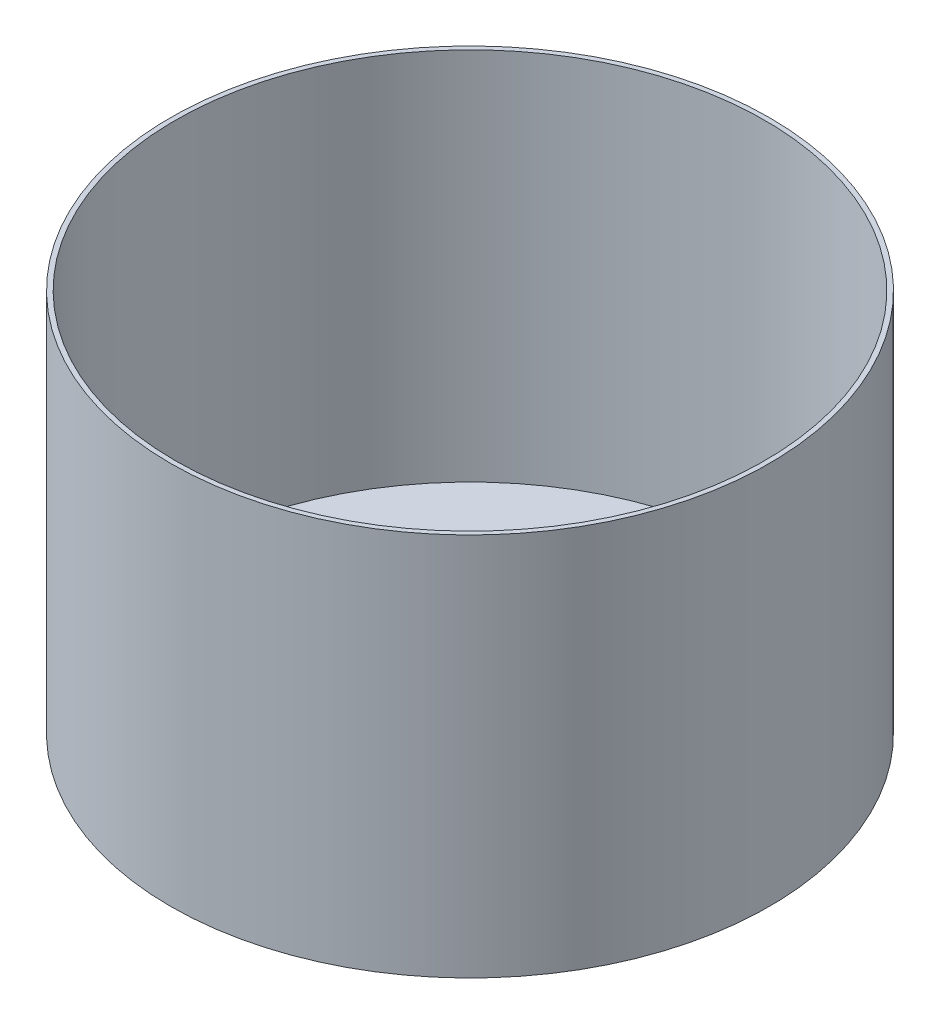
ISO-10303-21;
HEADER;
FILE_DESCRIPTION(('STEP AP214'),'2;1');
FILE_NAME('part.step','',(''),(''),'','','');
FILE_SCHEMA(('AUTOMOTIVE_DESIGN { 1 0 10303 214 1 1 1 1 }'));
ENDSEC;
DATA;
#1=APPLICATION_CONTEXT('core data for automotive mechanical design processes');
#2=APPLICATION_PROTOCOL_DEFINITION('international standard','automotive_design',2000,#1);
#3=PRODUCT_CONTEXT('',#1,'mechanical');
#4=PRODUCT('Part','Part','',(#3));
#5=PRODUCT_RELATED_PRODUCT_CATEGORY('part','',(#4));
#6=PRODUCT_DEFINITION_FORMATION('','',#4);
#7=PRODUCT_DEFINITION_CONTEXT('part definition',#1,'design');
#8=PRODUCT_DEFINITION('design','',#6,#7);
#9=PRODUCT_DEFINITION_SHAPE('','',#8);
#10=(LENGTH_UNIT() NAMED_UNIT(*) SI_UNIT(.MILLI.,.METRE.));
#11=(NAMED_UNIT(*) PLANE_ANGLE_UNIT() SI_UNIT($,.RADIAN.));
#12=(NAMED_UNIT(*) SI_UNIT($,.STERADIAN.) SOLID_ANGLE_UNIT());
#13=UNCERTAINTY_MEASURE_WITH_UNIT(LENGTH_MEASURE(1.E-05),#10,'distance_accuracy_value','');
#14=(GEOMETRIC_REPRESENTATION_CONTEXT(3) GLOBAL_UNCERTAINTY_ASSIGNED_CONTEXT((#13)) GLOBAL_UNIT_ASSIGNED_CONTEXT((#10,
#11,#12)) REPRESENTATION_CONTEXT('',''));
#15=CARTESIAN_POINT('',(0.,0.,0.));
#16=DIRECTION('',(0.,0.,1.));
#17=DIRECTION('',(1.,0.,0.));
#18=AXIS2_PLACEMENT_3D('',#15,#16,#17);
#19=CARTESIAN_POINT('',(0.,6.35,0.));
#20=DIRECTION('',(0.,1.,0.));
#21=DIRECTION('',(0.,0.,1.));
#22=AXIS2_PLACEMENT_3D('',#19,#20,#21);
#23=PLANE('',#22);
#24=CARTESIAN_POINT('',(0.,6.35,0.));
#25=DIRECTION('',(0.,1.,0.));
#26=DIRECTION('',(0.,0.,1.));
#27=AXIS2_PLACEMENT_3D('',#24,#25,#26);
#28=CIRCLE('',#27,200.025);
#29=CARTESIAN_POINT('',(0.,6.35,200.025));
#30=VERTEX_POINT('',#29);
#31=EDGE_CURVE('E18',#30,#30,#28,.T.);
#32=ORIENTED_EDGE('',*,*,#31,.T.);
#33=EDGE_LOOP('',(#32));
#34=FACE_BOUND('',#33,.T.);
#35=ADVANCED_FACE('F15',(#34),#23,.T.);
#36=CARTESIAN_POINT('',(0.,6.35,0.));
#37=DIRECTION('',(0.,1.,0.));
#38=DIRECTION('',(0.,0.,1.));
#39=AXIS2_PLACEMENT_3D('',#36,#37,#38);
#40=CYLINDRICAL_SURFACE('',#39,200.025);
#41=ORIENTED_EDGE('',*,*,#31,.F.);
#42=EDGE_LOOP('',(#41));
#43=FACE_BOUND('',#42,.T.);
#44=CARTESIAN_POINT('',(0.,260.35,0.));
#45=DIRECTION('',(0.,1.,0.));
#46=DIRECTION('',(0.,0.,1.));
#47=AXIS2_PLACEMENT_3D('',#44,#45,#46);
#48=CIRCLE('',#47,200.025);
#49=CARTESIAN_POINT('',(0.,260.35,200.025));
#50=VERTEX_POINT('',#49);
#51=EDGE_CURVE('E27',#50,#50,#48,.F.);
#52=ORIENTED_EDGE('',*,*,#51,.F.);
#53=EDGE_LOOP('',(#52));
#54=FACE_BOUND('',#53,.T.);
#55=ADVANCED_FACE('F36',(#43,#54),#40,.F.);
#56=CARTESIAN_POINT('',(0.,260.35,0.));
#57=DIRECTION('',(0.,1.,0.));
#58=DIRECTION('',(0.,0.,1.));
#59=AXIS2_PLACEMENT_3D('',#56,#57,#58);
#60=PLANE('',#59);
#61=ORIENTED_EDGE('',*,*,#51,.T.);
#62=EDGE_LOOP('',(#61));
#63=FACE_BOUND('',#62,.T.);
#64=CARTESIAN_POINT('',(0.,260.35,0.));
#65=DIRECTION('',(0.,1.,0.));
#66=DIRECTION('',(0.,0.,1.));
#67=AXIS2_PLACEMENT_3D('',#64,#65,#66);
#68=CIRCLE('',#67,203.2);
#69=CARTESIAN_POINT('',(0.,260.35,203.2));
#70=VERTEX_POINT('',#69);
#71=EDGE_CURVE('E22',#70,#70,#68,.F.);
#72=ORIENTED_EDGE('',*,*,#71,.F.);
#73=EDGE_LOOP('',(#72));
#74=FACE_BOUND('',#73,.T.);
#75=ADVANCED_FACE('F39',(#63,#74),#60,.T.);
#76=CARTESIAN_POINT('',(0.,0.,0.));
#77=DIRECTION('',(0.,1.,0.));
#78=DIRECTION('',(0.,0.,1.));
#79=AXIS2_PLACEMENT_3D('',#76,#77,#78);
#80=PLANE('',#79);
#81=CARTESIAN_POINT('',(0.,0.,0.));
#82=DIRECTION('',(0.,1.,0.));
#83=DIRECTION('',(0.,0.,1.));
#84=AXIS2_PLACEMENT_3D('',#81,#82,#83);
#85=CIRCLE('',#84,203.2);
#86=CARTESIAN_POINT('',(0.,0.,203.2));
#87=VERTEX_POINT('',#86);
#88=EDGE_CURVE('E10',#87,#87,#85,.T.);
#89=ORIENTED_EDGE('',*,*,#88,.F.);
#90=EDGE_LOOP('',(#89));
#91=FACE_BOUND('',#90,.T.);
#92=ADVANCED_FACE('F45',(#91),#80,.F.);
#93=CARTESIAN_POINT('',(0.,0.,0.));
#94=DIRECTION('',(0.,1.,0.));
#95=DIRECTION('',(0.,0.,1.));
#96=AXIS2_PLACEMENT_3D('',#93,#94,#95);
#97=CYLINDRICAL_SURFACE('',#96,203.2);
#98=ORIENTED_EDGE('',*,*,#88,.T.);
#99=EDGE_LOOP('',(#98));
#100=FACE_BOUND('',#99,.T.);
#101=ORIENTED_EDGE('',*,*,#71,.T.);
#102=EDGE_LOOP('',(#101));
#103=FACE_BOUND('',#102,.T.);
#104=ADVANCED_FACE('F47',(#100,#103),#97,.T.);
#105=CLOSED_SHELL('',(#35,#55,#75,#92,#104));
#106=MANIFOLD_SOLID_BREP('B1',#105);
#107=ADVANCED_BREP_SHAPE_REPRESENTATION('',(#18,#106),#14);
#108=SHAPE_DEFINITION_REPRESENTATION(#9,#107);
ENDSEC;
END-ISO-10303-21;
